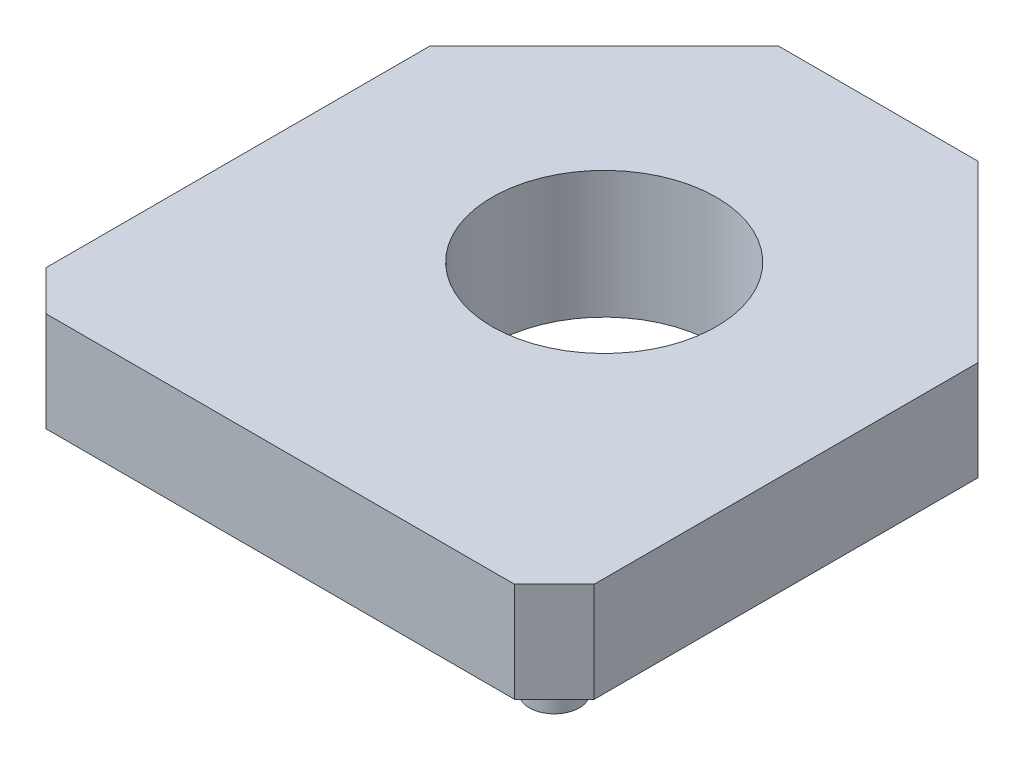
ISO-10303-21;
HEADER;
FILE_DESCRIPTION(('STEP AP214'),'2;1');
FILE_NAME('part.step','',(''),(''),'','','');
FILE_SCHEMA(('AUTOMOTIVE_DESIGN { 1 0 10303 214 1 1 1 1 }'));
ENDSEC;
DATA;
#1=APPLICATION_CONTEXT('core data for automotive mechanical design processes');
#2=APPLICATION_PROTOCOL_DEFINITION('international standard','automotive_design',2000,#1);
#3=PRODUCT_CONTEXT('',#1,'mechanical');
#4=PRODUCT('Part','Part','',(#3));
#5=PRODUCT_RELATED_PRODUCT_CATEGORY('part','',(#4));
#6=PRODUCT_DEFINITION_FORMATION('','',#4);
#7=PRODUCT_DEFINITION_CONTEXT('part definition',#1,'design');
#8=PRODUCT_DEFINITION('design','',#6,#7);
#9=PRODUCT_DEFINITION_SHAPE('','',#8);
#10=(LENGTH_UNIT() NAMED_UNIT(*) SI_UNIT(.MILLI.,.METRE.));
#11=(NAMED_UNIT(*) PLANE_ANGLE_UNIT() SI_UNIT($,.RADIAN.));
#12=(NAMED_UNIT(*) SI_UNIT($,.STERADIAN.) SOLID_ANGLE_UNIT());
#13=UNCERTAINTY_MEASURE_WITH_UNIT(LENGTH_MEASURE(1.E-05),#10,'distance_accuracy_value','');
#14=(GEOMETRIC_REPRESENTATION_CONTEXT(3) GLOBAL_UNCERTAINTY_ASSIGNED_CONTEXT((#13)) GLOBAL_UNIT_ASSIGNED_CONTEXT((#10,
#11,#12)) REPRESENTATION_CONTEXT('',''));
#15=CARTESIAN_POINT('',(0.,0.,0.));
#16=DIRECTION('',(0.,0.,1.));
#17=DIRECTION('',(1.,0.,0.));
#18=AXIS2_PLACEMENT_3D('',#15,#16,#17);
#19=CARTESIAN_POINT('',(-12.4060624608652,0.,-10.3399783307655));
#20=DIRECTION('',(0.,-1.,0.));
#21=DIRECTION('',(0.,0.,-1.));
#22=AXIS2_PLACEMENT_3D('',#19,#20,#21);
#23=PLANE('',#22);
#24=CARTESIAN_POINT('',(-16.4060624608652,0.,-16.5399783307654));
#25=DIRECTION('',(0.,-1.,0.));
#26=DIRECTION('',(0.,0.,-1.));
#27=AXIS2_PLACEMENT_3D('',#24,#25,#26);
#28=CIRCLE('',#27,0.499999999999999);
#29=CARTESIAN_POINT('',(-16.4060624608652,0.,-17.0399783307654));
#30=VERTEX_POINT('',#29);
#31=EDGE_CURVE('E191',#30,#30,#28,.T.);
#32=ORIENTED_EDGE('',*,*,#31,.F.);
#33=EDGE_LOOP('',(#32));
#34=FACE_BOUND('',#33,.T.);
#35=DIRECTION('',(0.70710678118655,0.,0.707106781186545));
#36=VECTOR('',#35,1.);
#37=CARTESIAN_POINT('',(-17.9060624608652,0.,-15.8399783307654));
#38=LINE('',#37,#36);
#39=CARTESIAN_POINT('',(-17.9060624608652,0.,-15.8399783307654));
#40=VERTEX_POINT('',#39);
#41=CARTESIAN_POINT('',(-17.1060624608652,0.,-15.0399783307654));
#42=VERTEX_POINT('',#41);
#43=EDGE_CURVE('E131',#40,#42,#38,.T.);
#44=ORIENTED_EDGE('',*,*,#43,.F.);
#45=DIRECTION('',(0.,0.,1.));
#46=VECTOR('',#45,1.);
#47=CARTESIAN_POINT('',(-17.9060624608652,0.,-15.8399783307654));
#48=LINE('',#47,#46);
#49=CARTESIAN_POINT('',(-17.9060624608652,0.,-23.5399783307654));
#50=VERTEX_POINT('',#49);
#51=EDGE_CURVE('E85',#50,#40,#48,.T.);
#52=ORIENTED_EDGE('',*,*,#51,.F.);
#53=DIRECTION('',(-0.707106781186546,0.,0.707106781186549));
#54=VECTOR('',#53,1.);
#55=CARTESIAN_POINT('',(-17.9060624608652,0.,-23.5399783307654));
#56=LINE('',#55,#54);
#57=CARTESIAN_POINT('',(-14.4060624608652,0.,-27.0399783307654));
#58=VERTEX_POINT('',#57);
#59=EDGE_CURVE('E79',#58,#50,#56,.T.);
#60=ORIENTED_EDGE('',*,*,#59,.F.);
#61=DIRECTION('',(-1.,0.,0.));
#62=VECTOR('',#61,1.);
#63=CARTESIAN_POINT('',(-14.4060624608652,0.,-27.0399783307654));
#64=LINE('',#63,#62);
#65=CARTESIAN_POINT('',(-10.4060624608652,0.,-27.0399783307654));
#66=VERTEX_POINT('',#65);
#67=EDGE_CURVE('E121',#66,#58,#64,.T.);
#68=ORIENTED_EDGE('',*,*,#67,.F.);
#69=DIRECTION('',(-0.707106781186546,0.,-0.707106781186549));
#70=VECTOR('',#69,1.);
#71=CARTESIAN_POINT('',(-6.9060624608652,0.,-23.5399783307654));
#72=LINE('',#71,#70);
#73=CARTESIAN_POINT('',(-6.9060624608652,0.,-23.5399783307654));
#74=VERTEX_POINT('',#73);
#75=EDGE_CURVE('E141',#74,#66,#72,.T.);
#76=ORIENTED_EDGE('',*,*,#75,.F.);
#77=DIRECTION('',(0.,0.,-1.));
#78=VECTOR('',#77,1.);
#79=CARTESIAN_POINT('',(-6.90606246086521,0.,-15.8399783307654));
#80=LINE('',#79,#78);
#81=CARTESIAN_POINT('',(-6.90606246086521,0.,-15.8399783307654));
#82=VERTEX_POINT('',#81);
#83=EDGE_CURVE('E139',#82,#74,#80,.T.);
#84=ORIENTED_EDGE('',*,*,#83,.F.);
#85=DIRECTION('',(0.70710678118655,0.,-0.707106781186545));
#86=VECTOR('',#85,1.);
#87=CARTESIAN_POINT('',(-6.90606246086521,0.,-15.8399783307654));
#88=LINE('',#87,#86);
#89=CARTESIAN_POINT('',(-7.70606246086522,0.,-15.0399783307654));
#90=VERTEX_POINT('',#89);
#91=EDGE_CURVE('E137',#90,#82,#88,.T.);
#92=ORIENTED_EDGE('',*,*,#91,.F.);
#93=DIRECTION('',(1.,0.,0.));
#94=VECTOR('',#93,1.);
#95=CARTESIAN_POINT('',(-17.1060624608652,0.,-15.0399783307654));
#96=LINE('',#95,#94);
#97=EDGE_CURVE('E134',#42,#90,#96,.T.);
#98=ORIENTED_EDGE('',*,*,#97,.F.);
#99=EDGE_LOOP('',(#44,#52,#60,#68,#76,#84,#92,#98));
#100=FACE_BOUND('',#99,.T.);
#101=CARTESIAN_POINT('',(-12.4060624608652,0.,-21.5399783307654));
#102=DIRECTION('',(0.,-1.,0.));
#103=DIRECTION('',(0.,0.,-1.));
#104=AXIS2_PLACEMENT_3D('',#101,#102,#103);
#105=CIRCLE('',#104,2.5);
#106=CARTESIAN_POINT('',(-12.4060624608652,0.,-24.0399783307654));
#107=VERTEX_POINT('',#106);
#108=EDGE_CURVE('E182',#107,#107,#105,.T.);
#109=ORIENTED_EDGE('',*,*,#108,.F.);
#110=EDGE_LOOP('',(#109));
#111=FACE_BOUND('',#110,.T.);
#112=CARTESIAN_POINT('',(-8.40606246086519,0.,-16.5399783307654));
#113=DIRECTION('',(0.,-1.,0.));
#114=DIRECTION('',(0.,0.,1.));
#115=AXIS2_PLACEMENT_3D('',#112,#113,#114);
#116=CIRCLE('',#115,0.499999999999999);
#117=CARTESIAN_POINT('',(-8.40606246086519,0.,-16.0399783307654));
#118=VERTEX_POINT('',#117);
#119=EDGE_CURVE('E197',#118,#118,#116,.T.);
#120=ORIENTED_EDGE('',*,*,#119,.F.);
#121=EDGE_LOOP('',(#120));
#122=FACE_BOUND('',#121,.T.);
#123=ADVANCED_FACE('F33',(#34,#100,#111,#122),#23,.T.);
#124=CARTESIAN_POINT('',(-12.4060624608652,2.,-10.3399783307655));
#125=DIRECTION('',(0.,-1.,0.));
#126=DIRECTION('',(0.,0.,-1.));
#127=AXIS2_PLACEMENT_3D('',#124,#125,#126);
#128=PLANE('',#127);
#129=DIRECTION('',(0.70710678118655,0.,0.707106781186545));
#130=VECTOR('',#129,1.);
#131=CARTESIAN_POINT('',(-17.9060624608652,2.,-15.8399783307654));
#132=LINE('',#131,#130);
#133=CARTESIAN_POINT('',(-17.9060624608652,2.,-15.8399783307654));
#134=VERTEX_POINT('',#133);
#135=CARTESIAN_POINT('',(-17.1060624608652,2.,-15.0399783307654));
#136=VERTEX_POINT('',#135);
#137=EDGE_CURVE('E146',#134,#136,#132,.T.);
#138=ORIENTED_EDGE('',*,*,#137,.T.);
#139=DIRECTION('',(1.,0.,0.));
#140=VECTOR('',#139,1.);
#141=CARTESIAN_POINT('',(-17.1060624608652,2.,-15.0399783307654));
#142=LINE('',#141,#140);
#143=CARTESIAN_POINT('',(-7.70606246086522,2.,-15.0399783307654));
#144=VERTEX_POINT('',#143);
#145=EDGE_CURVE('E93',#136,#144,#142,.T.);
#146=ORIENTED_EDGE('',*,*,#145,.T.);
#147=DIRECTION('',(0.70710678118655,0.,-0.707106781186545));
#148=VECTOR('',#147,1.);
#149=CARTESIAN_POINT('',(-6.90606246086521,2.,-15.8399783307654));
#150=LINE('',#149,#148);
#151=CARTESIAN_POINT('',(-6.90606246086521,2.,-15.8399783307654));
#152=VERTEX_POINT('',#151);
#153=EDGE_CURVE('E161',#144,#152,#150,.T.);
#154=ORIENTED_EDGE('',*,*,#153,.T.);
#155=DIRECTION('',(0.,0.,-1.));
#156=VECTOR('',#155,1.);
#157=CARTESIAN_POINT('',(-6.90606246086521,2.,-15.8399783307654));
#158=LINE('',#157,#156);
#159=CARTESIAN_POINT('',(-6.9060624608652,2.,-23.5399783307654));
#160=VERTEX_POINT('',#159);
#161=EDGE_CURVE('E173',#152,#160,#158,.T.);
#162=ORIENTED_EDGE('',*,*,#161,.T.);
#163=DIRECTION('',(-0.707106781186546,0.,-0.707106781186549));
#164=VECTOR('',#163,1.);
#165=CARTESIAN_POINT('',(-6.9060624608652,2.,-23.5399783307654));
#166=LINE('',#165,#164);
#167=CARTESIAN_POINT('',(-10.4060624608652,2.,-27.0399783307654));
#168=VERTEX_POINT('',#167);
#169=EDGE_CURVE('E113',#160,#168,#166,.T.);
#170=ORIENTED_EDGE('',*,*,#169,.T.);
#171=DIRECTION('',(-1.,0.,0.));
#172=VECTOR('',#171,1.);
#173=CARTESIAN_POINT('',(-14.4060624608652,2.,-27.0399783307654));
#174=LINE('',#173,#172);
#175=CARTESIAN_POINT('',(-14.4060624608652,2.,-27.0399783307654));
#176=VERTEX_POINT('',#175);
#177=EDGE_CURVE('E106',#168,#176,#174,.T.);
#178=ORIENTED_EDGE('',*,*,#177,.T.);
#179=DIRECTION('',(-0.707106781186546,0.,0.707106781186549));
#180=VECTOR('',#179,1.);
#181=CARTESIAN_POINT('',(-17.9060624608652,2.,-23.5399783307654));
#182=LINE('',#181,#180);
#183=CARTESIAN_POINT('',(-17.9060624608652,2.,-23.5399783307654));
#184=VERTEX_POINT('',#183);
#185=EDGE_CURVE('E111',#176,#184,#182,.T.);
#186=ORIENTED_EDGE('',*,*,#185,.T.);
#187=DIRECTION('',(0.,0.,1.));
#188=VECTOR('',#187,1.);
#189=CARTESIAN_POINT('',(-17.9060624608652,2.,-15.8399783307654));
#190=LINE('',#189,#188);
#191=EDGE_CURVE('E50',#184,#134,#190,.T.);
#192=ORIENTED_EDGE('',*,*,#191,.T.);
#193=EDGE_LOOP('',(#138,#146,#154,#162,#170,#178,#186,#192));
#194=FACE_BOUND('',#193,.T.);
#195=CARTESIAN_POINT('',(-12.4060624608652,2.,-21.5399783307654));
#196=DIRECTION('',(0.,1.,0.));
#197=DIRECTION('',(0.,0.,1.));
#198=AXIS2_PLACEMENT_3D('',#195,#196,#197);
#199=CIRCLE('',#198,2.25);
#200=CARTESIAN_POINT('',(-12.4060624608652,2.,-19.2899783307654));
#201=VERTEX_POINT('',#200);
#202=EDGE_CURVE('E135',#201,#201,#199,.T.);
#203=ORIENTED_EDGE('',*,*,#202,.F.);
#204=EDGE_LOOP('',(#203));
#205=FACE_BOUND('',#204,.T.);
#206=ADVANCED_FACE('F108',(#194,#205),#128,.F.);
#207=CARTESIAN_POINT('',(-17.9060624608652,2.,-15.8399783307654));
#208=DIRECTION('',(0.707106781186545,0.,-0.70710678118655));
#209=DIRECTION('',(-0.70710678118655,0.,-0.707106781186545));
#210=AXIS2_PLACEMENT_3D('',#207,#208,#209);
#211=PLANE('',#210);
#212=ORIENTED_EDGE('',*,*,#43,.T.);
#213=DIRECTION('',(0.,-1.,0.));
#214=VECTOR('',#213,1.);
#215=CARTESIAN_POINT('',(-17.1060624608652,2.,-15.0399783307654));
#216=LINE('',#215,#214);
#217=EDGE_CURVE('E11',#136,#42,#216,.T.);
#218=ORIENTED_EDGE('',*,*,#217,.F.);
#219=ORIENTED_EDGE('',*,*,#137,.F.);
#220=DIRECTION('',(0.,-1.,0.));
#221=VECTOR('',#220,1.);
#222=CARTESIAN_POINT('',(-17.9060624608652,2.,-15.8399783307654));
#223=LINE('',#222,#221);
#224=EDGE_CURVE('E127',#134,#40,#223,.T.);
#225=ORIENTED_EDGE('',*,*,#224,.T.);
#226=EDGE_LOOP('',(#212,#218,#219,#225));
#227=FACE_BOUND('',#226,.T.);
#228=ADVANCED_FACE('F35',(#227),#211,.F.);
#229=CARTESIAN_POINT('',(-17.1060624608652,2.,-15.0399783307654));
#230=DIRECTION('',(0.,0.,-1.));
#231=DIRECTION('',(-1.,0.,0.));
#232=AXIS2_PLACEMENT_3D('',#229,#230,#231);
#233=PLANE('',#232);
#234=ORIENTED_EDGE('',*,*,#97,.T.);
#235=DIRECTION('',(0.,-1.,0.));
#236=VECTOR('',#235,1.);
#237=CARTESIAN_POINT('',(-7.70606246086522,2.,-15.0399783307654));
#238=LINE('',#237,#236);
#239=EDGE_CURVE('E42',#144,#90,#238,.T.);
#240=ORIENTED_EDGE('',*,*,#239,.F.);
#241=ORIENTED_EDGE('',*,*,#145,.F.);
#242=ORIENTED_EDGE('',*,*,#217,.T.);
#243=EDGE_LOOP('',(#234,#240,#241,#242));
#244=FACE_BOUND('',#243,.T.);
#245=ADVANCED_FACE('F235',(#244),#233,.F.);
#246=CARTESIAN_POINT('',(-6.90606246086521,2.,-15.8399783307654));
#247=DIRECTION('',(-0.707106781186545,0.,-0.70710678118655));
#248=DIRECTION('',(-0.70710678118655,0.,0.707106781186545));
#249=AXIS2_PLACEMENT_3D('',#246,#247,#248);
#250=PLANE('',#249);
#251=ORIENTED_EDGE('',*,*,#91,.T.);
#252=DIRECTION('',(0.,-1.,0.));
#253=VECTOR('',#252,1.);
#254=CARTESIAN_POINT('',(-6.90606246086521,2.,-15.8399783307654));
#255=LINE('',#254,#253);
#256=EDGE_CURVE('E153',#152,#82,#255,.T.);
#257=ORIENTED_EDGE('',*,*,#256,.F.);
#258=ORIENTED_EDGE('',*,*,#153,.F.);
#259=ORIENTED_EDGE('',*,*,#239,.T.);
#260=EDGE_LOOP('',(#251,#257,#258,#259));
#261=FACE_BOUND('',#260,.T.);
#262=ADVANCED_FACE('F159',(#261),#250,.F.);
#263=CARTESIAN_POINT('',(-6.90606246086521,2.,-15.8399783307654));
#264=DIRECTION('',(-1.,0.,0.));
#265=DIRECTION('',(0.,0.,1.));
#266=AXIS2_PLACEMENT_3D('',#263,#264,#265);
#267=PLANE('',#266);
#268=ORIENTED_EDGE('',*,*,#83,.T.);
#269=DIRECTION('',(0.,-1.,0.));
#270=VECTOR('',#269,1.);
#271=CARTESIAN_POINT('',(-6.9060624608652,2.,-23.5399783307654));
#272=LINE('',#271,#270);
#273=EDGE_CURVE('E150',#160,#74,#272,.T.);
#274=ORIENTED_EDGE('',*,*,#273,.F.);
#275=ORIENTED_EDGE('',*,*,#161,.F.);
#276=ORIENTED_EDGE('',*,*,#256,.T.);
#277=EDGE_LOOP('',(#268,#274,#275,#276));
#278=FACE_BOUND('',#277,.T.);
#279=ADVANCED_FACE('F169',(#278),#267,.F.);
#280=CARTESIAN_POINT('',(-6.9060624608652,2.,-23.5399783307654));
#281=DIRECTION('',(-0.707106781186549,0.,0.707106781186546));
#282=DIRECTION('',(0.707106781186546,0.,0.707106781186549));
#283=AXIS2_PLACEMENT_3D('',#280,#281,#282);
#284=PLANE('',#283);
#285=ORIENTED_EDGE('',*,*,#75,.T.);
#286=DIRECTION('',(0.,-1.,0.));
#287=VECTOR('',#286,1.);
#288=CARTESIAN_POINT('',(-10.4060624608652,2.,-27.0399783307654));
#289=LINE('',#288,#287);
#290=EDGE_CURVE('E122',#168,#66,#289,.T.);
#291=ORIENTED_EDGE('',*,*,#290,.F.);
#292=ORIENTED_EDGE('',*,*,#169,.F.);
#293=ORIENTED_EDGE('',*,*,#273,.T.);
#294=EDGE_LOOP('',(#285,#291,#292,#293));
#295=FACE_BOUND('',#294,.T.);
#296=ADVANCED_FACE('F172',(#295),#284,.F.);
#297=CARTESIAN_POINT('',(-14.4060624608652,2.,-27.0399783307654));
#298=DIRECTION('',(0.,0.,1.));
#299=DIRECTION('',(1.,0.,0.));
#300=AXIS2_PLACEMENT_3D('',#297,#298,#299);
#301=PLANE('',#300);
#302=ORIENTED_EDGE('',*,*,#67,.T.);
#303=DIRECTION('',(0.,-1.,0.));
#304=VECTOR('',#303,1.);
#305=CARTESIAN_POINT('',(-14.4060624608652,2.,-27.0399783307654));
#306=LINE('',#305,#304);
#307=EDGE_CURVE('E118',#176,#58,#306,.T.);
#308=ORIENTED_EDGE('',*,*,#307,.F.);
#309=ORIENTED_EDGE('',*,*,#177,.F.);
#310=ORIENTED_EDGE('',*,*,#290,.T.);
#311=EDGE_LOOP('',(#302,#308,#309,#310));
#312=FACE_BOUND('',#311,.T.);
#313=ADVANCED_FACE('F119',(#312),#301,.F.);
#314=CARTESIAN_POINT('',(-17.9060624608652,2.,-23.5399783307654));
#315=DIRECTION('',(0.707106781186549,0.,0.707106781186546));
#316=DIRECTION('',(0.707106781186546,0.,-0.707106781186549));
#317=AXIS2_PLACEMENT_3D('',#314,#315,#316);
#318=PLANE('',#317);
#319=ORIENTED_EDGE('',*,*,#59,.T.);
#320=DIRECTION('',(0.,-1.,0.));
#321=VECTOR('',#320,1.);
#322=CARTESIAN_POINT('',(-17.9060624608652,2.,-23.5399783307654));
#323=LINE('',#322,#321);
#324=EDGE_CURVE('E123',#184,#50,#323,.T.);
#325=ORIENTED_EDGE('',*,*,#324,.F.);
#326=ORIENTED_EDGE('',*,*,#185,.F.);
#327=ORIENTED_EDGE('',*,*,#307,.T.);
#328=EDGE_LOOP('',(#319,#325,#326,#327));
#329=FACE_BOUND('',#328,.T.);
#330=ADVANCED_FACE('F125',(#329),#318,.F.);
#331=CARTESIAN_POINT('',(-17.9060624608652,2.,-15.8399783307654));
#332=DIRECTION('',(1.,0.,0.));
#333=DIRECTION('',(0.,0.,-1.));
#334=AXIS2_PLACEMENT_3D('',#331,#332,#333);
#335=PLANE('',#334);
#336=ORIENTED_EDGE('',*,*,#51,.T.);
#337=ORIENTED_EDGE('',*,*,#224,.F.);
#338=ORIENTED_EDGE('',*,*,#191,.F.);
#339=ORIENTED_EDGE('',*,*,#324,.T.);
#340=EDGE_LOOP('',(#336,#337,#338,#339));
#341=FACE_BOUND('',#340,.T.);
#342=ADVANCED_FACE('F222',(#341),#335,.F.);
#343=CARTESIAN_POINT('',(-12.4060624608652,2.,-21.5399783307654));
#344=DIRECTION('',(0.,-1.,0.));
#345=DIRECTION('',(0.,0.,-1.));
#346=AXIS2_PLACEMENT_3D('',#343,#344,#345);
#347=CYLINDRICAL_SURFACE('',#346,2.25);
#348=ORIENTED_EDGE('',*,*,#202,.T.);
#349=EDGE_LOOP('',(#348));
#350=FACE_BOUND('',#349,.T.);
#351=CARTESIAN_POINT('',(-12.4060624608652,-0.55,-21.5399783307654));
#352=DIRECTION('',(0.,-1.,0.));
#353=DIRECTION('',(0.,0.,-1.));
#354=AXIS2_PLACEMENT_3D('',#351,#352,#353);
#355=CIRCLE('',#354,2.25);
#356=CARTESIAN_POINT('',(-12.4060624608652,-0.55,-23.7899783307654));
#357=VERTEX_POINT('',#356);
#358=EDGE_CURVE('E185',#357,#357,#355,.T.);
#359=ORIENTED_EDGE('',*,*,#358,.T.);
#360=EDGE_LOOP('',(#359));
#361=FACE_BOUND('',#360,.T.);
#362=ADVANCED_FACE('F225',(#350,#361),#347,.F.);
#363=CARTESIAN_POINT('',(-12.4060624608652,-0.55,-21.5399783307654));
#364=DIRECTION('',(0.,-1.,0.));
#365=DIRECTION('',(0.,0.,-1.));
#366=AXIS2_PLACEMENT_3D('',#363,#364,#365);
#367=PLANE('',#366);
#368=CARTESIAN_POINT('',(-12.4060624608652,-0.55,-21.5399783307654));
#369=DIRECTION('',(0.,-1.,0.));
#370=DIRECTION('',(0.,0.,-1.));
#371=AXIS2_PLACEMENT_3D('',#368,#369,#370);
#372=CIRCLE('',#371,2.5);
#373=CARTESIAN_POINT('',(-12.4060624608652,-0.55,-24.0399783307654));
#374=VERTEX_POINT('',#373);
#375=EDGE_CURVE('E181',#374,#374,#372,.T.);
#376=ORIENTED_EDGE('',*,*,#375,.T.);
#377=EDGE_LOOP('',(#376));
#378=FACE_BOUND('',#377,.T.);
#379=ORIENTED_EDGE('',*,*,#358,.F.);
#380=EDGE_LOOP('',(#379));
#381=FACE_BOUND('',#380,.T.);
#382=ADVANCED_FACE('F295',(#378,#381),#367,.T.);
#383=CARTESIAN_POINT('',(-12.4060624608652,-0.55,-21.5399783307654));
#384=DIRECTION('',(0.,1.,0.));
#385=DIRECTION('',(0.,0.,1.));
#386=AXIS2_PLACEMENT_3D('',#383,#384,#385);
#387=CYLINDRICAL_SURFACE('',#386,2.5);
#388=ORIENTED_EDGE('',*,*,#375,.F.);
#389=EDGE_LOOP('',(#388));
#390=FACE_BOUND('',#389,.T.);
#391=ORIENTED_EDGE('',*,*,#108,.T.);
#392=EDGE_LOOP('',(#391));
#393=FACE_BOUND('',#392,.T.);
#394=ADVANCED_FACE('F306',(#390,#393),#387,.T.);
#395=CARTESIAN_POINT('',(-16.4060624608652,-1.,-16.5399783307654));
#396=DIRECTION('',(0.,1.,0.));
#397=DIRECTION('',(0.,0.,1.));
#398=AXIS2_PLACEMENT_3D('',#395,#396,#397);
#399=CYLINDRICAL_SURFACE('',#398,0.499999999999999);
#400=CARTESIAN_POINT('',(-16.4060624608652,-1.,-16.5399783307654));
#401=DIRECTION('',(0.,-1.,0.));
#402=DIRECTION('',(0.,0.,-1.));
#403=AXIS2_PLACEMENT_3D('',#400,#401,#402);
#404=CIRCLE('',#403,0.499999999999999);
#405=CARTESIAN_POINT('',(-16.4060624608652,-1.,-17.0399783307654));
#406=VERTEX_POINT('',#405);
#407=EDGE_CURVE('E190',#406,#406,#404,.T.);
#408=ORIENTED_EDGE('',*,*,#407,.F.);
#409=EDGE_LOOP('',(#408));
#410=FACE_BOUND('',#409,.T.);
#411=ORIENTED_EDGE('',*,*,#31,.T.);
#412=EDGE_LOOP('',(#411));
#413=FACE_BOUND('',#412,.T.);
#414=ADVANCED_FACE('F315',(#410,#413),#399,.T.);
#415=CARTESIAN_POINT('',(-16.4060624608652,-1.,-16.5399783307654));
#416=DIRECTION('',(0.,-1.,0.));
#417=DIRECTION('',(0.,0.,-1.));
#418=AXIS2_PLACEMENT_3D('',#415,#416,#417);
#419=PLANE('',#418);
#420=ORIENTED_EDGE('',*,*,#407,.T.);
#421=EDGE_LOOP('',(#420));
#422=FACE_BOUND('',#421,.T.);
#423=ADVANCED_FACE('F208',(#422),#419,.T.);
#424=CARTESIAN_POINT('',(-8.40606246086519,-1.,-16.5399783307654));
#425=DIRECTION('',(0.,1.,0.));
#426=DIRECTION('',(0.,0.,1.));
#427=AXIS2_PLACEMENT_3D('',#424,#425,#426);
#428=CYLINDRICAL_SURFACE('',#427,0.499999999999999);
#429=CARTESIAN_POINT('',(-8.40606246086519,-1.,-16.5399783307654));
#430=DIRECTION('',(0.,-1.,0.));
#431=DIRECTION('',(0.,0.,1.));
#432=AXIS2_PLACEMENT_3D('',#429,#430,#431);
#433=CIRCLE('',#432,0.499999999999999);
#434=CARTESIAN_POINT('',(-8.40606246086519,-1.,-16.0399783307654));
#435=VERTEX_POINT('',#434);
#436=EDGE_CURVE('E194',#435,#435,#433,.T.);
#437=ORIENTED_EDGE('',*,*,#436,.F.);
#438=EDGE_LOOP('',(#437));
#439=FACE_BOUND('',#438,.T.);
#440=ORIENTED_EDGE('',*,*,#119,.T.);
#441=EDGE_LOOP('',(#440));
#442=FACE_BOUND('',#441,.T.);
#443=ADVANCED_FACE('F205',(#439,#442),#428,.T.);
#444=CARTESIAN_POINT('',(-8.40606246086519,-1.,-16.5399783307654));
#445=DIRECTION('',(0.,1.,0.));
#446=DIRECTION('',(0.,0.,1.));
#447=AXIS2_PLACEMENT_3D('',#444,#445,#446);
#448=PLANE('',#447);
#449=ORIENTED_EDGE('',*,*,#436,.T.);
#450=EDGE_LOOP('',(#449));
#451=FACE_BOUND('',#450,.T.);
#452=ADVANCED_FACE('F203',(#451),#448,.F.);
#453=CLOSED_SHELL('',(#123,#206,#228,#245,#262,#279,#296,#313,#330,#342,#362,#382,#394,#414,
#423,#443,#452));
#454=MANIFOLD_SOLID_BREP('B2',#453);
#455=ADVANCED_BREP_SHAPE_REPRESENTATION('',(#18,#454),#14);
#456=SHAPE_DEFINITION_REPRESENTATION(#9,#455);
ENDSEC;
END-ISO-10303-21;
